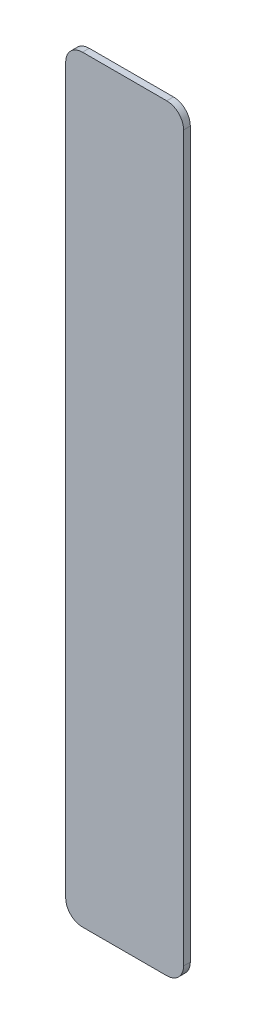
ISO-10303-21;
HEADER;
FILE_DESCRIPTION(('STEP AP214'),'2;1');
FILE_NAME('part.step','',(''),(''),'','','');
FILE_SCHEMA(('AUTOMOTIVE_DESIGN { 1 0 10303 214 1 1 1 1 }'));
ENDSEC;
DATA;
#1=APPLICATION_CONTEXT('core data for automotive mechanical design processes');
#2=APPLICATION_PROTOCOL_DEFINITION('international standard','automotive_design',2000,#1);
#3=PRODUCT_CONTEXT('',#1,'mechanical');
#4=PRODUCT('Part','Part','',(#3));
#5=PRODUCT_RELATED_PRODUCT_CATEGORY('part','',(#4));
#6=PRODUCT_DEFINITION_FORMATION('','',#4);
#7=PRODUCT_DEFINITION_CONTEXT('part definition',#1,'design');
#8=PRODUCT_DEFINITION('design','',#6,#7);
#9=PRODUCT_DEFINITION_SHAPE('','',#8);
#10=(LENGTH_UNIT() NAMED_UNIT(*) SI_UNIT(.MILLI.,.METRE.));
#11=(NAMED_UNIT(*) PLANE_ANGLE_UNIT() SI_UNIT($,.RADIAN.));
#12=(NAMED_UNIT(*) SI_UNIT($,.STERADIAN.) SOLID_ANGLE_UNIT());
#13=UNCERTAINTY_MEASURE_WITH_UNIT(LENGTH_MEASURE(1.E-05),#10,'distance_accuracy_value','');
#14=(GEOMETRIC_REPRESENTATION_CONTEXT(3) GLOBAL_UNCERTAINTY_ASSIGNED_CONTEXT((#13)) GLOBAL_UNIT_ASSIGNED_CONTEXT((#10,
#11,#12)) REPRESENTATION_CONTEXT('',''));
#15=CARTESIAN_POINT('',(0.,0.,0.));
#16=DIRECTION('',(0.,0.,1.));
#17=DIRECTION('',(1.,0.,0.));
#18=AXIS2_PLACEMENT_3D('',#15,#16,#17);
#19=CARTESIAN_POINT('',(-3.5,-22.5,0.4));
#20=DIRECTION('',(1.,0.,0.));
#21=DIRECTION('',(0.,0.,-1.));
#22=AXIS2_PLACEMENT_3D('',#19,#20,#21);
#23=PLANE('',#22);
#24=DIRECTION('',(0.,-1.,0.));
#25=VECTOR('',#24,1.);
#26=CARTESIAN_POINT('',(-3.5,-22.5,0.));
#27=LINE('',#26,#25);
#28=CARTESIAN_POINT('',(-3.5,21.5,0.));
#29=VERTEX_POINT('',#28);
#30=CARTESIAN_POINT('',(-3.5,-21.5,0.));
#31=VERTEX_POINT('',#30);
#32=EDGE_CURVE('E143',#29,#31,#27,.T.);
#33=ORIENTED_EDGE('',*,*,#32,.T.);
#34=DIRECTION('',(0.,0.,-1.));
#35=VECTOR('',#34,1.);
#36=CARTESIAN_POINT('',(-3.5,-21.5,0.4));
#37=LINE('',#36,#35);
#38=CARTESIAN_POINT('',(-3.5,-21.5,0.4));
#39=VERTEX_POINT('',#38);
#40=EDGE_CURVE('E118',#31,#39,#37,.F.);
#41=ORIENTED_EDGE('',*,*,#40,.T.);
#42=DIRECTION('',(0.,-1.,0.));
#43=VECTOR('',#42,1.);
#44=CARTESIAN_POINT('',(-3.5,-22.5,0.4));
#45=LINE('',#44,#43);
#46=CARTESIAN_POINT('',(-3.5,21.5,0.4));
#47=VERTEX_POINT('',#46);
#48=EDGE_CURVE('E155',#47,#39,#45,.T.);
#49=ORIENTED_EDGE('',*,*,#48,.F.);
#50=DIRECTION('',(0.,0.,-1.));
#51=VECTOR('',#50,1.);
#52=CARTESIAN_POINT('',(-3.5,21.5,0.4));
#53=LINE('',#52,#51);
#54=EDGE_CURVE('E124',#47,#29,#53,.T.);
#55=ORIENTED_EDGE('',*,*,#54,.T.);
#56=EDGE_LOOP('',(#33,#41,#49,#55));
#57=FACE_BOUND('',#56,.T.);
#58=ADVANCED_FACE('F47',(#57),#23,.F.);
#59=CARTESIAN_POINT('',(3.5,-22.5,0.4));
#60=DIRECTION('',(0.,1.,0.));
#61=DIRECTION('',(0.,0.,1.));
#62=AXIS2_PLACEMENT_3D('',#59,#60,#61);
#63=PLANE('',#62);
#64=DIRECTION('',(1.,0.,0.));
#65=VECTOR('',#64,1.);
#66=CARTESIAN_POINT('',(3.5,-22.5,0.4));
#67=LINE('',#66,#65);
#68=CARTESIAN_POINT('',(-2.5,-22.5,0.4));
#69=VERTEX_POINT('',#68);
#70=CARTESIAN_POINT('',(2.5,-22.5,0.4));
#71=VERTEX_POINT('',#70);
#72=EDGE_CURVE('E134',#69,#71,#67,.T.);
#73=ORIENTED_EDGE('',*,*,#72,.F.);
#74=DIRECTION('',(0.,0.,-1.));
#75=VECTOR('',#74,1.);
#76=CARTESIAN_POINT('',(-2.5,-22.5,0.4));
#77=LINE('',#76,#75);
#78=CARTESIAN_POINT('',(-2.5,-22.5,0.));
#79=VERTEX_POINT('',#78);
#80=EDGE_CURVE('E117',#69,#79,#77,.T.);
#81=ORIENTED_EDGE('',*,*,#80,.T.);
#82=DIRECTION('',(1.,0.,0.));
#83=VECTOR('',#82,1.);
#84=CARTESIAN_POINT('',(3.5,-22.5,0.));
#85=LINE('',#84,#83);
#86=CARTESIAN_POINT('',(2.5,-22.5,0.));
#87=VERTEX_POINT('',#86);
#88=EDGE_CURVE('E131',#79,#87,#85,.T.);
#89=ORIENTED_EDGE('',*,*,#88,.T.);
#90=DIRECTION('',(0.,0.,-1.));
#91=VECTOR('',#90,1.);
#92=CARTESIAN_POINT('',(2.5,-22.5,0.4));
#93=LINE('',#92,#91);
#94=EDGE_CURVE('E137',#87,#71,#93,.F.);
#95=ORIENTED_EDGE('',*,*,#94,.T.);
#96=EDGE_LOOP('',(#73,#81,#89,#95));
#97=FACE_BOUND('',#96,.T.);
#98=ADVANCED_FACE('F130',(#97),#63,.F.);
#99=CARTESIAN_POINT('',(3.5,-22.5,0.4));
#100=DIRECTION('',(-1.,0.,0.));
#101=DIRECTION('',(0.,0.,1.));
#102=AXIS2_PLACEMENT_3D('',#99,#100,#101);
#103=PLANE('',#102);
#104=DIRECTION('',(0.,1.,0.));
#105=VECTOR('',#104,1.);
#106=CARTESIAN_POINT('',(3.5,-22.5,0.4));
#107=LINE('',#106,#105);
#108=CARTESIAN_POINT('',(3.5,-21.5,0.4));
#109=VERTEX_POINT('',#108);
#110=CARTESIAN_POINT('',(3.5,21.5,0.4));
#111=VERTEX_POINT('',#110);
#112=EDGE_CURVE('E204',#109,#111,#107,.T.);
#113=ORIENTED_EDGE('',*,*,#112,.F.);
#114=DIRECTION('',(0.,0.,-1.));
#115=VECTOR('',#114,1.);
#116=CARTESIAN_POINT('',(3.5,-21.5,0.4));
#117=LINE('',#116,#115);
#118=CARTESIAN_POINT('',(3.5,-21.5,0.));
#119=VERTEX_POINT('',#118);
#120=EDGE_CURVE('E185',#109,#119,#117,.T.);
#121=ORIENTED_EDGE('',*,*,#120,.T.);
#122=DIRECTION('',(0.,1.,0.));
#123=VECTOR('',#122,1.);
#124=CARTESIAN_POINT('',(3.5,-22.5,0.));
#125=LINE('',#124,#123);
#126=CARTESIAN_POINT('',(3.5,21.5,0.));
#127=VERTEX_POINT('',#126);
#128=EDGE_CURVE('E142',#119,#127,#125,.T.);
#129=ORIENTED_EDGE('',*,*,#128,.T.);
#130=DIRECTION('',(0.,0.,-1.));
#131=VECTOR('',#130,1.);
#132=CARTESIAN_POINT('',(3.5,21.5,0.4));
#133=LINE('',#132,#131);
#134=EDGE_CURVE('E182',#127,#111,#133,.F.);
#135=ORIENTED_EDGE('',*,*,#134,.T.);
#136=EDGE_LOOP('',(#113,#121,#129,#135));
#137=FACE_BOUND('',#136,.T.);
#138=ADVANCED_FACE('F217',(#137),#103,.F.);
#139=CARTESIAN_POINT('',(3.5,22.5,0.4));
#140=DIRECTION('',(0.,-1.,0.));
#141=DIRECTION('',(1.,0.,0.));
#142=AXIS2_PLACEMENT_3D('',#139,#140,#141);
#143=PLANE('',#142);
#144=DIRECTION('',(-1.,0.,0.));
#145=VECTOR('',#144,1.);
#146=CARTESIAN_POINT('',(3.5,22.5,0.));
#147=LINE('',#146,#145);
#148=CARTESIAN_POINT('',(2.5,22.5,0.));
#149=VERTEX_POINT('',#148);
#150=CARTESIAN_POINT('',(-2.5,22.5,0.));
#151=VERTEX_POINT('',#150);
#152=EDGE_CURVE('E148',#149,#151,#147,.T.);
#153=ORIENTED_EDGE('',*,*,#152,.T.);
#154=DIRECTION('',(0.,0.,-1.));
#155=VECTOR('',#154,1.);
#156=CARTESIAN_POINT('',(-2.5,22.5,0.4));
#157=LINE('',#156,#155);
#158=CARTESIAN_POINT('',(-2.5,22.5,0.4));
#159=VERTEX_POINT('',#158);
#160=EDGE_CURVE('E11',#151,#159,#157,.F.);
#161=ORIENTED_EDGE('',*,*,#160,.T.);
#162=DIRECTION('',(-1.,0.,0.));
#163=VECTOR('',#162,1.);
#164=CARTESIAN_POINT('',(3.5,22.5,0.4));
#165=LINE('',#164,#163);
#166=CARTESIAN_POINT('',(2.5,22.5,0.4));
#167=VERTEX_POINT('',#166);
#168=EDGE_CURVE('E157',#167,#159,#165,.T.);
#169=ORIENTED_EDGE('',*,*,#168,.F.);
#170=DIRECTION('',(0.,0.,-1.));
#171=VECTOR('',#170,1.);
#172=CARTESIAN_POINT('',(2.5,22.5,0.4));
#173=LINE('',#172,#171);
#174=EDGE_CURVE('E56',#167,#149,#173,.T.);
#175=ORIENTED_EDGE('',*,*,#174,.T.);
#176=EDGE_LOOP('',(#153,#161,#169,#175));
#177=FACE_BOUND('',#176,.T.);
#178=ADVANCED_FACE('F192',(#177),#143,.F.);
#179=CARTESIAN_POINT('',(0.,0.,0.4));
#180=DIRECTION('',(0.,0.,1.));
#181=DIRECTION('',(1.,0.,0.));
#182=AXIS2_PLACEMENT_3D('',#179,#180,#181);
#183=PLANE('',#182);
#184=ORIENTED_EDGE('',*,*,#48,.T.);
#185=CARTESIAN_POINT('',(-2.5,-21.5,0.4));
#186=DIRECTION('',(0.,0.,1.));
#187=DIRECTION('',(1.,0.,0.));
#188=AXIS2_PLACEMENT_3D('',#185,#186,#187);
#189=CIRCLE('',#188,1.);
#190=EDGE_CURVE('E179',#39,#69,#189,.T.);
#191=ORIENTED_EDGE('',*,*,#190,.T.);
#192=ORIENTED_EDGE('',*,*,#72,.T.);
#193=CARTESIAN_POINT('',(2.5,-21.5,0.4));
#194=DIRECTION('',(0.,0.,1.));
#195=DIRECTION('',(1.,0.,0.));
#196=AXIS2_PLACEMENT_3D('',#193,#194,#195);
#197=CIRCLE('',#196,1.);
#198=EDGE_CURVE('E176',#71,#109,#197,.T.);
#199=ORIENTED_EDGE('',*,*,#198,.T.);
#200=ORIENTED_EDGE('',*,*,#112,.T.);
#201=CARTESIAN_POINT('',(2.5,21.5,0.4));
#202=DIRECTION('',(0.,0.,1.));
#203=DIRECTION('',(1.,0.,0.));
#204=AXIS2_PLACEMENT_3D('',#201,#202,#203);
#205=CIRCLE('',#204,1.);
#206=EDGE_CURVE('E68',#111,#167,#205,.T.);
#207=ORIENTED_EDGE('',*,*,#206,.T.);
#208=ORIENTED_EDGE('',*,*,#168,.T.);
#209=CARTESIAN_POINT('',(-2.5,21.5,0.4));
#210=DIRECTION('',(0.,0.,1.));
#211=DIRECTION('',(1.,0.,0.));
#212=AXIS2_PLACEMENT_3D('',#209,#210,#211);
#213=CIRCLE('',#212,1.);
#214=EDGE_CURVE('E173',#159,#47,#213,.T.);
#215=ORIENTED_EDGE('',*,*,#214,.T.);
#216=EDGE_LOOP('',(#184,#191,#192,#199,#200,#207,#208,#215));
#217=FACE_BOUND('',#216,.T.);
#218=ADVANCED_FACE('F209',(#217),#183,.T.);
#219=CARTESIAN_POINT('',(0.,0.,0.));
#220=DIRECTION('',(0.,0.,1.));
#221=DIRECTION('',(1.,0.,0.));
#222=AXIS2_PLACEMENT_3D('',#219,#220,#221);
#223=PLANE('',#222);
#224=ORIENTED_EDGE('',*,*,#88,.F.);
#225=CARTESIAN_POINT('',(-2.5,-21.5,0.));
#226=DIRECTION('',(0.,0.,1.));
#227=DIRECTION('',(1.,0.,0.));
#228=AXIS2_PLACEMENT_3D('',#225,#226,#227);
#229=CIRCLE('',#228,1.);
#230=EDGE_CURVE('E113',#79,#31,#229,.F.);
#231=ORIENTED_EDGE('',*,*,#230,.T.);
#232=ORIENTED_EDGE('',*,*,#32,.F.);
#233=CARTESIAN_POINT('',(-2.5,21.5,0.));
#234=DIRECTION('',(0.,0.,1.));
#235=DIRECTION('',(1.,0.,0.));
#236=AXIS2_PLACEMENT_3D('',#233,#234,#235);
#237=CIRCLE('',#236,1.);
#238=EDGE_CURVE('E161',#29,#151,#237,.F.);
#239=ORIENTED_EDGE('',*,*,#238,.T.);
#240=ORIENTED_EDGE('',*,*,#152,.F.);
#241=CARTESIAN_POINT('',(2.5,21.5,0.));
#242=DIRECTION('',(0.,0.,1.));
#243=DIRECTION('',(1.,0.,0.));
#244=AXIS2_PLACEMENT_3D('',#241,#242,#243);
#245=CIRCLE('',#244,1.);
#246=EDGE_CURVE('E136',#149,#127,#245,.F.);
#247=ORIENTED_EDGE('',*,*,#246,.T.);
#248=ORIENTED_EDGE('',*,*,#128,.F.);
#249=CARTESIAN_POINT('',(2.5,-21.5,0.));
#250=DIRECTION('',(0.,0.,1.));
#251=DIRECTION('',(1.,0.,0.));
#252=AXIS2_PLACEMENT_3D('',#249,#250,#251);
#253=CIRCLE('',#252,1.);
#254=EDGE_CURVE('E125',#119,#87,#253,.F.);
#255=ORIENTED_EDGE('',*,*,#254,.T.);
#256=EDGE_LOOP('',(#224,#231,#232,#239,#240,#247,#248,#255));
#257=FACE_BOUND('',#256,.T.);
#258=ADVANCED_FACE('F139',(#257),#223,.F.);
#259=CARTESIAN_POINT('',(-2.5,-21.5,0.4));
#260=DIRECTION('',(0.,0.,-1.));
#261=DIRECTION('',(-1.,0.,0.));
#262=AXIS2_PLACEMENT_3D('',#259,#260,#261);
#263=CYLINDRICAL_SURFACE('',#262,1.);
#264=ORIENTED_EDGE('',*,*,#190,.F.);
#265=ORIENTED_EDGE('',*,*,#40,.F.);
#266=ORIENTED_EDGE('',*,*,#230,.F.);
#267=ORIENTED_EDGE('',*,*,#80,.F.);
#268=EDGE_LOOP('',(#264,#265,#266,#267));
#269=FACE_BOUND('',#268,.T.);
#270=ADVANCED_FACE('F116',(#269),#263,.T.);
#271=CARTESIAN_POINT('',(2.5,-21.5,0.4));
#272=DIRECTION('',(0.,0.,-1.));
#273=DIRECTION('',(-1.,0.,0.));
#274=AXIS2_PLACEMENT_3D('',#271,#272,#273);
#275=CYLINDRICAL_SURFACE('',#274,1.);
#276=ORIENTED_EDGE('',*,*,#198,.F.);
#277=ORIENTED_EDGE('',*,*,#94,.F.);
#278=ORIENTED_EDGE('',*,*,#254,.F.);
#279=ORIENTED_EDGE('',*,*,#120,.F.);
#280=EDGE_LOOP('',(#276,#277,#278,#279));
#281=FACE_BOUND('',#280,.T.);
#282=ADVANCED_FACE('F229',(#281),#275,.T.);
#283=CARTESIAN_POINT('',(-2.5,21.5,0.4));
#284=DIRECTION('',(0.,0.,-1.));
#285=DIRECTION('',(-1.,0.,0.));
#286=AXIS2_PLACEMENT_3D('',#283,#284,#285);
#287=CYLINDRICAL_SURFACE('',#286,1.);
#288=ORIENTED_EDGE('',*,*,#214,.F.);
#289=ORIENTED_EDGE('',*,*,#160,.F.);
#290=ORIENTED_EDGE('',*,*,#238,.F.);
#291=ORIENTED_EDGE('',*,*,#54,.F.);
#292=EDGE_LOOP('',(#288,#289,#290,#291));
#293=FACE_BOUND('',#292,.T.);
#294=ADVANCED_FACE('F197',(#293),#287,.T.);
#295=CARTESIAN_POINT('',(2.5,21.5,0.4));
#296=DIRECTION('',(0.,0.,-1.));
#297=DIRECTION('',(-1.,0.,0.));
#298=AXIS2_PLACEMENT_3D('',#295,#296,#297);
#299=CYLINDRICAL_SURFACE('',#298,1.);
#300=ORIENTED_EDGE('',*,*,#206,.F.);
#301=ORIENTED_EDGE('',*,*,#134,.F.);
#302=ORIENTED_EDGE('',*,*,#246,.F.);
#303=ORIENTED_EDGE('',*,*,#174,.F.);
#304=EDGE_LOOP('',(#300,#301,#302,#303));
#305=FACE_BOUND('',#304,.T.);
#306=ADVANCED_FACE('F49',(#305),#299,.T.);
#307=CLOSED_SHELL('',(#58,#98,#138,#178,#218,#258,#270,#282,#294,#306));
#308=MANIFOLD_SOLID_BREP('B2',#307);
#309=ADVANCED_BREP_SHAPE_REPRESENTATION('',(#18,#308),#14);
#310=SHAPE_DEFINITION_REPRESENTATION(#9,#309);
ENDSEC;
END-ISO-10303-21;
